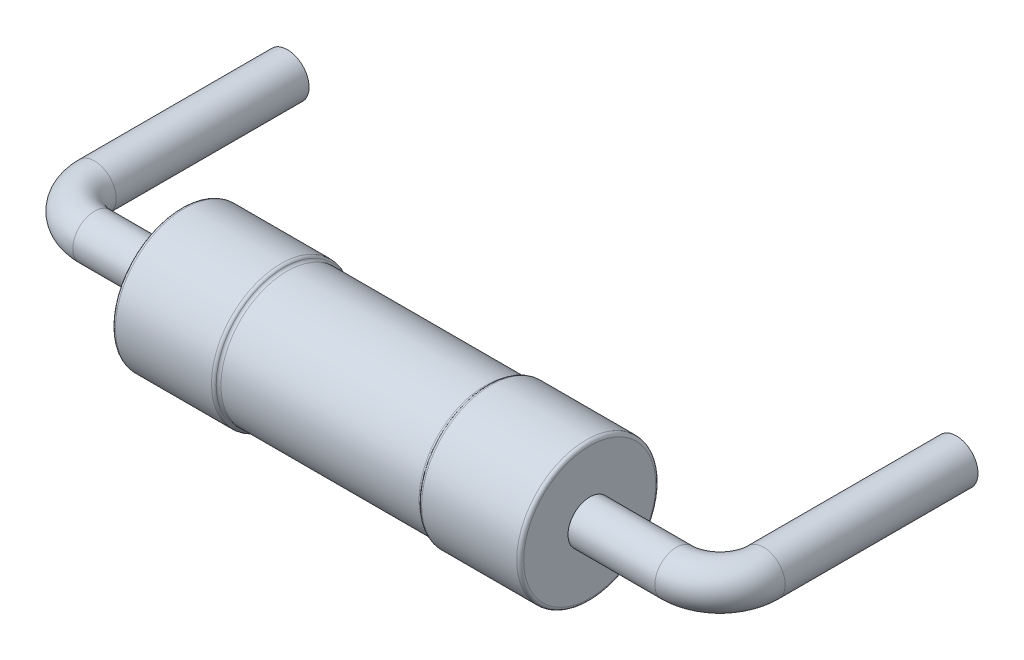
ISO-10303-21;
HEADER;
FILE_DESCRIPTION(('STEP AP214'),'2;1');
FILE_NAME('part.step','',(''),(''),'','','');
FILE_SCHEMA(('AUTOMOTIVE_DESIGN { 1 0 10303 214 1 1 1 1 }'));
ENDSEC;
DATA;
#1=APPLICATION_CONTEXT('core data for automotive mechanical design processes');
#2=APPLICATION_PROTOCOL_DEFINITION('international standard','automotive_design',2000,#1);
#3=PRODUCT_CONTEXT('',#1,'mechanical');
#4=PRODUCT('Part','Part','',(#3));
#5=PRODUCT_RELATED_PRODUCT_CATEGORY('part','',(#4));
#6=PRODUCT_DEFINITION_FORMATION('','',#4);
#7=PRODUCT_DEFINITION_CONTEXT('part definition',#1,'design');
#8=PRODUCT_DEFINITION('design','',#6,#7);
#9=PRODUCT_DEFINITION_SHAPE('','',#8);
#10=(LENGTH_UNIT() NAMED_UNIT(*) SI_UNIT(.MILLI.,.METRE.));
#11=(NAMED_UNIT(*) PLANE_ANGLE_UNIT() SI_UNIT($,.RADIAN.));
#12=(NAMED_UNIT(*) SI_UNIT($,.STERADIAN.) SOLID_ANGLE_UNIT());
#13=UNCERTAINTY_MEASURE_WITH_UNIT(LENGTH_MEASURE(1.E-05),#10,'distance_accuracy_value','');
#14=(GEOMETRIC_REPRESENTATION_CONTEXT(3) GLOBAL_UNCERTAINTY_ASSIGNED_CONTEXT((#13)) GLOBAL_UNIT_ASSIGNED_CONTEXT((#10,
#11,#12)) REPRESENTATION_CONTEXT('',''));
#15=CARTESIAN_POINT('',(0.,0.,0.));
#16=DIRECTION('',(0.,0.,1.));
#17=DIRECTION('',(1.,0.,0.));
#18=AXIS2_PLACEMENT_3D('',#15,#16,#17);
#19=CARTESIAN_POINT('',(3.85,0.,-0.809999999999999));
#20=DIRECTION('',(0.,0.,-1.));
#21=DIRECTION('',(0.,-1.,0.));
#22=AXIS2_PLACEMENT_3D('',#19,#20,#21);
#23=CYLINDRICAL_SURFACE('',#22,0.25);
#24=CARTESIAN_POINT('',(3.85,0.,0.3));
#25=DIRECTION('',(0.,0.,-1.));
#26=DIRECTION('',(0.,-1.,0.));
#27=AXIS2_PLACEMENT_3D('',#24,#25,#26);
#28=CIRCLE('',#27,0.25);
#29=CARTESIAN_POINT('',(4.1,0.,0.3));
#30=VERTEX_POINT('',#29);
#31=EDGE_CURVE('E9',#30,#30,#28,.T.);
#32=ORIENTED_EDGE('',*,*,#31,.T.);
#33=EDGE_LOOP('',(#32));
#34=FACE_BOUND('',#33,.T.);
#35=CARTESIAN_POINT('',(3.85,0.,-1.92));
#36=DIRECTION('',(0.,0.,-1.));
#37=DIRECTION('',(0.,-1.,0.));
#38=AXIS2_PLACEMENT_3D('',#35,#36,#37);
#39=CIRCLE('',#38,0.25);
#40=CARTESIAN_POINT('',(3.85,-0.25,-1.92));
#41=VERTEX_POINT('',#40);
#42=EDGE_CURVE('E22',#41,#41,#39,.T.);
#43=ORIENTED_EDGE('',*,*,#42,.F.);
#44=EDGE_LOOP('',(#43));
#45=FACE_BOUND('',#44,.T.);
#46=ADVANCED_FACE('F14',(#34,#45),#23,.T.);
#47=CARTESIAN_POINT('',(3.85,0.,-1.92));
#48=DIRECTION('',(0.,0.,-1.));
#49=DIRECTION('',(-1.,0.,0.));
#50=AXIS2_PLACEMENT_3D('',#47,#48,#49);
#51=PLANE('',#50);
#52=ORIENTED_EDGE('',*,*,#42,.T.);
#53=EDGE_LOOP('',(#52));
#54=FACE_BOUND('',#53,.T.);
#55=ADVANCED_FACE('F93',(#54),#51,.T.);
#56=CARTESIAN_POINT('',(3.35,0.,0.3));
#57=DIRECTION('',(0.,1.,0.));
#58=DIRECTION('',(1.,0.,0.));
#59=AXIS2_PLACEMENT_3D('',#56,#57,#58);
#60=TOROIDAL_SURFACE('',#59,0.5,0.25);
#61=CARTESIAN_POINT('',(3.35,0.,0.8));
#62=DIRECTION('',(1.,0.,0.));
#63=DIRECTION('',(0.,0.,1.));
#64=AXIS2_PLACEMENT_3D('',#61,#62,#63);
#65=CIRCLE('',#64,0.25);
#66=CARTESIAN_POINT('',(3.35,0.,1.05));
#67=VERTEX_POINT('',#66);
#68=EDGE_CURVE('E27',#67,#67,#65,.T.);
#69=CARTESIAN_POINT('',(3.35,0.,0.3));
#70=DIRECTION('',(0.,1.,0.));
#71=DIRECTION('',(1.,0.,0.));
#72=AXIS2_PLACEMENT_3D('',#69,#70,#71);
#73=CIRCLE('',#72,0.75);
#74=EDGE_CURVE('',#67,#30,#73,.T.);
#75=ORIENTED_EDGE('',*,*,#68,.T.);
#76=ORIENTED_EDGE('',*,*,#31,.F.);
#77=ORIENTED_EDGE('',*,*,#74,.T.);
#78=ORIENTED_EDGE('',*,*,#74,.F.);
#79=EDGE_LOOP('',(#75,#77,#76,#78));
#80=FACE_BOUND('',#79,.T.);
#81=ADVANCED_FACE('F87',(#80),#60,.T.);
#82=CARTESIAN_POINT('',(2.85,0.,0.8));
#83=DIRECTION('',(1.,0.,0.));
#84=DIRECTION('',(0.,0.,1.));
#85=AXIS2_PLACEMENT_3D('',#82,#83,#84);
#86=CYLINDRICAL_SURFACE('',#85,0.25);
#87=CARTESIAN_POINT('',(2.35,0.,0.8));
#88=DIRECTION('',(-1.,0.,0.));
#89=DIRECTION('',(0.,0.,1.));
#90=AXIS2_PLACEMENT_3D('',#87,#88,#89);
#91=CIRCLE('',#90,0.25);
#92=CARTESIAN_POINT('',(2.35,0.,1.05));
#93=VERTEX_POINT('',#92);
#94=EDGE_CURVE('E33',#93,#93,#91,.T.);
#95=ORIENTED_EDGE('',*,*,#94,.F.);
#96=EDGE_LOOP('',(#95));
#97=FACE_BOUND('',#96,.T.);
#98=ORIENTED_EDGE('',*,*,#68,.F.);
#99=EDGE_LOOP('',(#98));
#100=FACE_BOUND('',#99,.T.);
#101=ADVANCED_FACE('F83',(#97,#100),#86,.T.);
#102=CARTESIAN_POINT('',(-3.85,0.,-0.81));
#103=DIRECTION('',(0.,0.,1.));
#104=DIRECTION('',(1.,0.,0.));
#105=AXIS2_PLACEMENT_3D('',#102,#103,#104);
#106=CYLINDRICAL_SURFACE('',#105,0.25);
#107=CARTESIAN_POINT('',(-3.85,0.,-1.92));
#108=DIRECTION('',(0.,0.,1.));
#109=DIRECTION('',(1.,0.,0.));
#110=AXIS2_PLACEMENT_3D('',#107,#108,#109);
#111=CIRCLE('',#110,0.25);
#112=CARTESIAN_POINT('',(-3.6,0.,-1.92));
#113=VERTEX_POINT('',#112);
#114=EDGE_CURVE('E32',#113,#113,#111,.T.);
#115=ORIENTED_EDGE('',*,*,#114,.T.);
#116=EDGE_LOOP('',(#115));
#117=FACE_BOUND('',#116,.T.);
#118=CARTESIAN_POINT('',(-3.85,0.,0.3));
#119=DIRECTION('',(0.,0.,1.));
#120=DIRECTION('',(1.,0.,0.));
#121=AXIS2_PLACEMENT_3D('',#118,#119,#120);
#122=CIRCLE('',#121,0.25);
#123=CARTESIAN_POINT('',(-4.1,0.,0.3));
#124=VERTEX_POINT('',#123);
#125=EDGE_CURVE('E39',#124,#124,#122,.T.);
#126=ORIENTED_EDGE('',*,*,#125,.F.);
#127=EDGE_LOOP('',(#126));
#128=FACE_BOUND('',#127,.T.);
#129=ADVANCED_FACE('F86',(#117,#128),#106,.T.);
#130=CARTESIAN_POINT('',(-3.85,0.,-1.92));
#131=DIRECTION('',(0.,0.,1.));
#132=DIRECTION('',(1.,0.,0.));
#133=AXIS2_PLACEMENT_3D('',#130,#131,#132);
#134=PLANE('',#133);
#135=ORIENTED_EDGE('',*,*,#114,.F.);
#136=EDGE_LOOP('',(#135));
#137=FACE_BOUND('',#136,.T.);
#138=ADVANCED_FACE('F111',(#137),#134,.F.);
#139=CARTESIAN_POINT('',(-3.35,0.,0.3));
#140=DIRECTION('',(0.,1.,0.));
#141=DIRECTION('',(1.,0.,0.));
#142=AXIS2_PLACEMENT_3D('',#139,#140,#141);
#143=TOROIDAL_SURFACE('',#142,0.5,0.25);
#144=CARTESIAN_POINT('',(-3.35,0.,0.8));
#145=DIRECTION('',(1.,0.,0.));
#146=DIRECTION('',(0.,0.,1.));
#147=AXIS2_PLACEMENT_3D('',#144,#145,#146);
#148=CIRCLE('',#147,0.25);
#149=CARTESIAN_POINT('',(-3.35,0.,1.05));
#150=VERTEX_POINT('',#149);
#151=EDGE_CURVE('E42',#150,#150,#148,.T.);
#152=CARTESIAN_POINT('',(-3.35,0.,0.3));
#153=DIRECTION('',(0.,1.,0.));
#154=DIRECTION('',(1.,0.,0.));
#155=AXIS2_PLACEMENT_3D('',#152,#153,#154);
#156=CIRCLE('',#155,0.75);
#157=EDGE_CURVE('',#124,#150,#156,.T.);
#158=ORIENTED_EDGE('',*,*,#125,.T.);
#159=ORIENTED_EDGE('',*,*,#151,.F.);
#160=ORIENTED_EDGE('',*,*,#157,.T.);
#161=ORIENTED_EDGE('',*,*,#157,.F.);
#162=EDGE_LOOP('',(#158,#160,#159,#161));
#163=FACE_BOUND('',#162,.T.);
#164=ADVANCED_FACE('F117',(#163),#143,.T.);
#165=CARTESIAN_POINT('',(-2.85,0.,0.8));
#166=DIRECTION('',(1.,0.,0.));
#167=DIRECTION('',(0.,0.,1.));
#168=AXIS2_PLACEMENT_3D('',#165,#166,#167);
#169=CYLINDRICAL_SURFACE('',#168,0.25);
#170=ORIENTED_EDGE('',*,*,#151,.T.);
#171=EDGE_LOOP('',(#170));
#172=FACE_BOUND('',#171,.T.);
#173=CARTESIAN_POINT('',(-2.35,0.,0.8));
#174=DIRECTION('',(1.,0.,0.));
#175=DIRECTION('',(0.,0.,1.));
#176=AXIS2_PLACEMENT_3D('',#173,#174,#175);
#177=CIRCLE('',#176,0.25);
#178=CARTESIAN_POINT('',(-2.35,0.,1.05));
#179=VERTEX_POINT('',#178);
#180=EDGE_CURVE('E46',#179,#179,#177,.T.);
#181=ORIENTED_EDGE('',*,*,#180,.F.);
#182=EDGE_LOOP('',(#181));
#183=FACE_BOUND('',#182,.T.);
#184=ADVANCED_FACE('F113',(#172,#183),#169,.T.);
#185=CARTESIAN_POINT('',(-1.20428203230276,0.,0.8));
#186=DIRECTION('',(1.,0.,0.));
#187=DIRECTION('',(0.,0.,1.));
#188=AXIS2_PLACEMENT_3D('',#185,#186,#187);
#189=TOROIDAL_SURFACE('',#188,0.76,0.04);
#190=CARTESIAN_POINT('',(-1.20428203230276,0.,0.8));
#191=DIRECTION('',(1.,0.,0.));
#192=DIRECTION('',(0.,0.,1.));
#193=AXIS2_PLACEMENT_3D('',#190,#191,#192);
#194=CIRCLE('',#193,0.8);
#195=CARTESIAN_POINT('',(-1.20428203230276,0.,1.6));
#196=VERTEX_POINT('',#195);
#197=EDGE_CURVE('E45',#196,#196,#194,.T.);
#198=ORIENTED_EDGE('',*,*,#197,.T.);
#199=EDGE_LOOP('',(#198));
#200=FACE_BOUND('',#199,.T.);
#201=CARTESIAN_POINT('',(-1.16964101615138,0.,0.8));
#202=DIRECTION('',(-1.,0.,0.));
#203=DIRECTION('',(0.,0.,1.));
#204=AXIS2_PLACEMENT_3D('',#201,#202,#203);
#205=CIRCLE('',#204,0.78);
#206=CARTESIAN_POINT('',(-1.16964101615138,0.,1.58));
#207=VERTEX_POINT('',#206);
#208=EDGE_CURVE('E53',#207,#207,#205,.T.);
#209=ORIENTED_EDGE('',*,*,#208,.T.);
#210=EDGE_LOOP('',(#209));
#211=FACE_BOUND('',#210,.T.);
#212=ADVANCED_FACE('F116',(#200,#211),#189,.T.);
#213=CARTESIAN_POINT('',(-1.7625,0.,0.8));
#214=DIRECTION('',(1.,0.,0.));
#215=DIRECTION('',(0.,0.,1.));
#216=AXIS2_PLACEMENT_3D('',#213,#214,#215);
#217=CYLINDRICAL_SURFACE('',#216,0.8);
#218=CARTESIAN_POINT('',(-2.31,0.,0.8));
#219=DIRECTION('',(-1.,0.,0.));
#220=DIRECTION('',(0.,0.,1.));
#221=AXIS2_PLACEMENT_3D('',#218,#219,#220);
#222=CIRCLE('',#221,0.8);
#223=CARTESIAN_POINT('',(-2.31,0.,1.6));
#224=VERTEX_POINT('',#223);
#225=EDGE_CURVE('E56',#224,#224,#222,.T.);
#226=ORIENTED_EDGE('',*,*,#225,.F.);
#227=EDGE_LOOP('',(#226));
#228=FACE_BOUND('',#227,.T.);
#229=ORIENTED_EDGE('',*,*,#197,.F.);
#230=EDGE_LOOP('',(#229));
#231=FACE_BOUND('',#230,.T.);
#232=ADVANCED_FACE('F119',(#228,#231),#217,.T.);
#233=CARTESIAN_POINT('',(-2.31,0.,0.8));
#234=DIRECTION('',(-1.,0.,0.));
#235=DIRECTION('',(0.,0.,1.));
#236=AXIS2_PLACEMENT_3D('',#233,#234,#235);
#237=TOROIDAL_SURFACE('',#236,0.76,0.04);
#238=ORIENTED_EDGE('',*,*,#225,.T.);
#239=EDGE_LOOP('',(#238));
#240=FACE_BOUND('',#239,.T.);
#241=CARTESIAN_POINT('',(-2.35,0.,0.8));
#242=DIRECTION('',(1.,0.,0.));
#243=DIRECTION('',(0.,0.,1.));
#244=AXIS2_PLACEMENT_3D('',#241,#242,#243);
#245=CIRCLE('',#244,0.76);
#246=CARTESIAN_POINT('',(-2.35,0.,1.56));
#247=VERTEX_POINT('',#246);
#248=EDGE_CURVE('E49',#247,#247,#245,.T.);
#249=ORIENTED_EDGE('',*,*,#248,.T.);
#250=EDGE_LOOP('',(#249));
#251=FACE_BOUND('',#250,.T.);
#252=ADVANCED_FACE('F121',(#240,#251),#237,.T.);
#253=CARTESIAN_POINT('',(-2.35,0.,0.8));
#254=DIRECTION('',(-1.,0.,0.));
#255=DIRECTION('',(0.,0.,1.));
#256=AXIS2_PLACEMENT_3D('',#253,#254,#255);
#257=PLANE('',#256);
#258=ORIENTED_EDGE('',*,*,#248,.F.);
#259=EDGE_LOOP('',(#258));
#260=FACE_BOUND('',#259,.T.);
#261=ORIENTED_EDGE('',*,*,#180,.T.);
#262=EDGE_LOOP('',(#261));
#263=FACE_BOUND('',#262,.T.);
#264=ADVANCED_FACE('F134',(#260,#263),#257,.T.);
#265=CARTESIAN_POINT('',(1.14571796769725,0.,0.8));
#266=DIRECTION('',(1.,0.,0.));
#267=DIRECTION('',(0.,0.,1.));
#268=AXIS2_PLACEMENT_3D('',#265,#266,#267);
#269=TOROIDAL_SURFACE('',#268,0.8,0.04);
#270=CARTESIAN_POINT('',(1.14571796769725,0.,0.8));
#271=DIRECTION('',(1.,0.,0.));
#272=DIRECTION('',(0.,0.,1.));
#273=AXIS2_PLACEMENT_3D('',#270,#271,#272);
#274=CIRCLE('',#273,0.76);
#275=CARTESIAN_POINT('',(1.14571796769725,0.,1.56));
#276=VERTEX_POINT('',#275);
#277=EDGE_CURVE('E50',#276,#276,#274,.T.);
#278=ORIENTED_EDGE('',*,*,#277,.T.);
#279=EDGE_LOOP('',(#278));
#280=FACE_BOUND('',#279,.T.);
#281=CARTESIAN_POINT('',(1.18035898384862,0.,0.8));
#282=DIRECTION('',(-1.,0.,0.));
#283=DIRECTION('',(0.,0.,1.));
#284=AXIS2_PLACEMENT_3D('',#281,#282,#283);
#285=CIRCLE('',#284,0.78);
#286=CARTESIAN_POINT('',(1.18035898384862,0.,1.58));
#287=VERTEX_POINT('',#286);
#288=EDGE_CURVE('E63',#287,#287,#285,.T.);
#289=ORIENTED_EDGE('',*,*,#288,.T.);
#290=EDGE_LOOP('',(#289));
#291=FACE_BOUND('',#290,.T.);
#292=ADVANCED_FACE('F126',(#280,#291),#269,.F.);
#293=CARTESIAN_POINT('',(0.,0.,0.8));
#294=DIRECTION('',(1.,0.,0.));
#295=DIRECTION('',(0.,0.,1.));
#296=AXIS2_PLACEMENT_3D('',#293,#294,#295);
#297=CYLINDRICAL_SURFACE('',#296,0.76);
#298=CARTESIAN_POINT('',(-1.135,0.,0.8));
#299=DIRECTION('',(-1.,0.,0.));
#300=DIRECTION('',(0.,0.,1.));
#301=AXIS2_PLACEMENT_3D('',#298,#299,#300);
#302=CIRCLE('',#301,0.76);
#303=CARTESIAN_POINT('',(-1.135,0.,1.56));
#304=VERTEX_POINT('',#303);
#305=EDGE_CURVE('E66',#304,#304,#302,.T.);
#306=ORIENTED_EDGE('',*,*,#305,.F.);
#307=EDGE_LOOP('',(#306));
#308=FACE_BOUND('',#307,.T.);
#309=ORIENTED_EDGE('',*,*,#277,.F.);
#310=EDGE_LOOP('',(#309));
#311=FACE_BOUND('',#310,.T.);
#312=ADVANCED_FACE('F123',(#308,#311),#297,.T.);
#313=CARTESIAN_POINT('',(-1.135,0.,0.8));
#314=DIRECTION('',(-1.,0.,0.));
#315=DIRECTION('',(0.,0.,1.));
#316=AXIS2_PLACEMENT_3D('',#313,#314,#315);
#317=TOROIDAL_SURFACE('',#316,0.8,0.04);
#318=ORIENTED_EDGE('',*,*,#305,.T.);
#319=EDGE_LOOP('',(#318));
#320=FACE_BOUND('',#319,.T.);
#321=ORIENTED_EDGE('',*,*,#208,.F.);
#322=EDGE_LOOP('',(#321));
#323=FACE_BOUND('',#322,.T.);
#324=ADVANCED_FACE('F125',(#320,#323),#317,.F.);
#325=CARTESIAN_POINT('',(2.31,0.,0.8));
#326=DIRECTION('',(1.,0.,0.));
#327=DIRECTION('',(0.,0.,1.));
#328=AXIS2_PLACEMENT_3D('',#325,#326,#327);
#329=TOROIDAL_SURFACE('',#328,0.76,0.04);
#330=CARTESIAN_POINT('',(2.31,0.,0.8));
#331=DIRECTION('',(1.,0.,0.));
#332=DIRECTION('',(0.,0.,1.));
#333=AXIS2_PLACEMENT_3D('',#330,#331,#332);
#334=CIRCLE('',#333,0.8);
#335=CARTESIAN_POINT('',(2.31,0.,1.6));
#336=VERTEX_POINT('',#335);
#337=EDGE_CURVE('E69',#336,#336,#334,.T.);
#338=ORIENTED_EDGE('',*,*,#337,.T.);
#339=EDGE_LOOP('',(#338));
#340=FACE_BOUND('',#339,.T.);
#341=CARTESIAN_POINT('',(2.35,0.,0.8));
#342=DIRECTION('',(-1.,0.,0.));
#343=DIRECTION('',(0.,0.,1.));
#344=AXIS2_PLACEMENT_3D('',#341,#342,#343);
#345=CIRCLE('',#344,0.76);
#346=CARTESIAN_POINT('',(2.35,0.,1.56));
#347=VERTEX_POINT('',#346);
#348=EDGE_CURVE('E36',#347,#347,#345,.T.);
#349=ORIENTED_EDGE('',*,*,#348,.T.);
#350=EDGE_LOOP('',(#349));
#351=FACE_BOUND('',#350,.T.);
#352=ADVANCED_FACE('F74',(#340,#351),#329,.T.);
#353=CARTESIAN_POINT('',(1.7625,0.,0.8));
#354=DIRECTION('',(1.,0.,0.));
#355=DIRECTION('',(0.,0.,1.));
#356=AXIS2_PLACEMENT_3D('',#353,#354,#355);
#357=CYLINDRICAL_SURFACE('',#356,0.8);
#358=CARTESIAN_POINT('',(1.215,0.,0.8));
#359=DIRECTION('',(-1.,0.,0.));
#360=DIRECTION('',(0.,0.,1.));
#361=AXIS2_PLACEMENT_3D('',#358,#359,#360);
#362=CIRCLE('',#361,0.8);
#363=CARTESIAN_POINT('',(1.215,0.,1.6));
#364=VERTEX_POINT('',#363);
#365=EDGE_CURVE('E18',#364,#364,#362,.T.);
#366=ORIENTED_EDGE('',*,*,#365,.F.);
#367=EDGE_LOOP('',(#366));
#368=FACE_BOUND('',#367,.T.);
#369=ORIENTED_EDGE('',*,*,#337,.F.);
#370=EDGE_LOOP('',(#369));
#371=FACE_BOUND('',#370,.T.);
#372=ADVANCED_FACE('F16',(#368,#371),#357,.T.);
#373=CARTESIAN_POINT('',(2.35,0.,0.8));
#374=DIRECTION('',(1.,0.,0.));
#375=DIRECTION('',(0.,0.,-1.));
#376=AXIS2_PLACEMENT_3D('',#373,#374,#375);
#377=PLANE('',#376);
#378=ORIENTED_EDGE('',*,*,#348,.F.);
#379=EDGE_LOOP('',(#378));
#380=FACE_BOUND('',#379,.T.);
#381=ORIENTED_EDGE('',*,*,#94,.T.);
#382=EDGE_LOOP('',(#381));
#383=FACE_BOUND('',#382,.T.);
#384=ADVANCED_FACE('F76',(#380,#383),#377,.T.);
#385=CARTESIAN_POINT('',(1.215,0.,0.8));
#386=DIRECTION('',(-1.,0.,0.));
#387=DIRECTION('',(0.,0.,1.));
#388=AXIS2_PLACEMENT_3D('',#385,#386,#387);
#389=TOROIDAL_SURFACE('',#388,0.76,0.04);
#390=ORIENTED_EDGE('',*,*,#365,.T.);
#391=EDGE_LOOP('',(#390));
#392=FACE_BOUND('',#391,.T.);
#393=ORIENTED_EDGE('',*,*,#288,.F.);
#394=EDGE_LOOP('',(#393));
#395=FACE_BOUND('',#394,.T.);
#396=ADVANCED_FACE('F79',(#392,#395),#389,.T.);
#397=CLOSED_SHELL('',(#46,#55,#81,#101,#129,#138,#164,#184,#212,#232,#252,#264,#292,#312,#324,
#352,#372,#384,#396));
#398=MANIFOLD_SOLID_BREP('B1',#397);
#399=ADVANCED_BREP_SHAPE_REPRESENTATION('',(#18,#398),#14);
#400=SHAPE_DEFINITION_REPRESENTATION(#9,#399);
ENDSEC;
END-ISO-10303-21;
